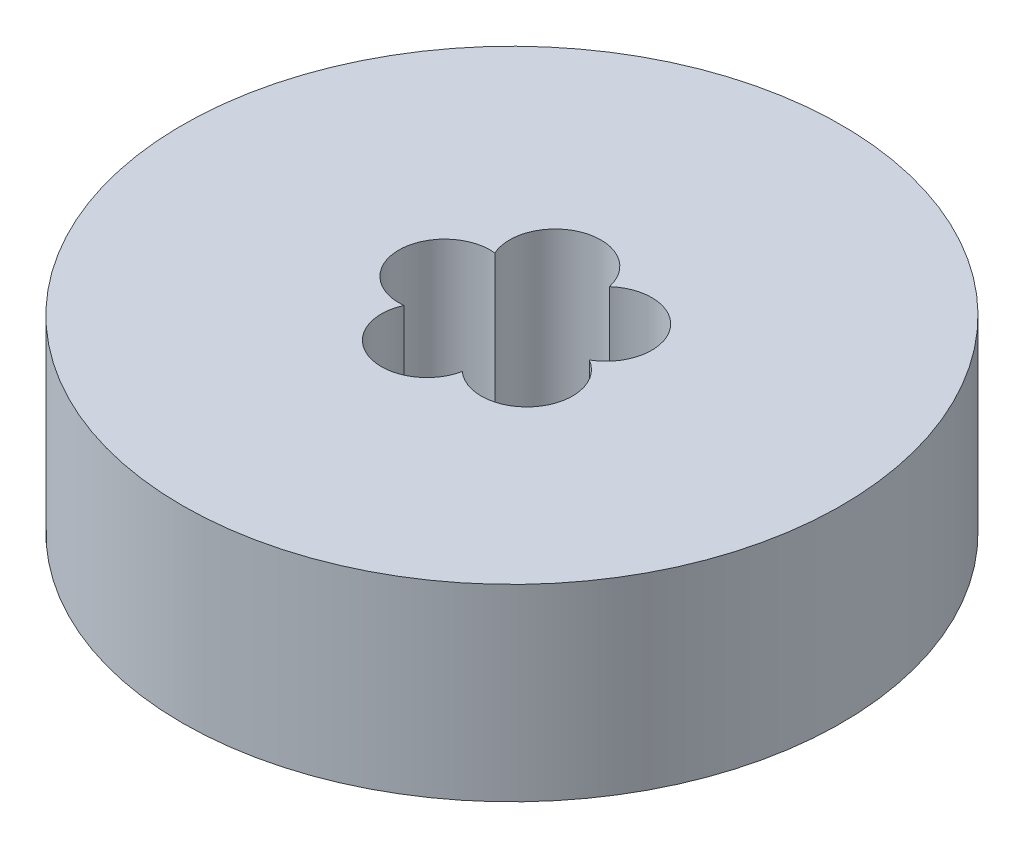
ISO-10303-21;
HEADER;
FILE_DESCRIPTION(('STEP AP214'),'2;1');
FILE_NAME('part.step','',(''),(''),'','','');
FILE_SCHEMA(('AUTOMOTIVE_DESIGN { 1 0 10303 214 1 1 1 1 }'));
ENDSEC;
DATA;
#1=APPLICATION_CONTEXT('core data for automotive mechanical design processes');
#2=APPLICATION_PROTOCOL_DEFINITION('international standard','automotive_design',2000,#1);
#3=PRODUCT_CONTEXT('',#1,'mechanical');
#4=PRODUCT('Part','Part','',(#3));
#5=PRODUCT_RELATED_PRODUCT_CATEGORY('part','',(#4));
#6=PRODUCT_DEFINITION_FORMATION('','',#4);
#7=PRODUCT_DEFINITION_CONTEXT('part definition',#1,'design');
#8=PRODUCT_DEFINITION('design','',#6,#7);
#9=PRODUCT_DEFINITION_SHAPE('','',#8);
#10=(LENGTH_UNIT() NAMED_UNIT(*) SI_UNIT(.MILLI.,.METRE.));
#11=(NAMED_UNIT(*) PLANE_ANGLE_UNIT() SI_UNIT($,.RADIAN.));
#12=(NAMED_UNIT(*) SI_UNIT($,.STERADIAN.) SOLID_ANGLE_UNIT());
#13=UNCERTAINTY_MEASURE_WITH_UNIT(LENGTH_MEASURE(1.E-05),#10,'distance_accuracy_value','');
#14=(GEOMETRIC_REPRESENTATION_CONTEXT(3) GLOBAL_UNCERTAINTY_ASSIGNED_CONTEXT((#13)) GLOBAL_UNIT_ASSIGNED_CONTEXT((#10,
#11,#12)) REPRESENTATION_CONTEXT('',''));
#15=CARTESIAN_POINT('',(0.,0.,0.));
#16=DIRECTION('',(0.,0.,1.));
#17=DIRECTION('',(1.,0.,0.));
#18=AXIS2_PLACEMENT_3D('',#15,#16,#17);
#19=CARTESIAN_POINT('',(0.,20.,0.));
#20=DIRECTION('',(0.,-1.,0.));
#21=DIRECTION('',(0.,0.,-1.));
#22=AXIS2_PLACEMENT_3D('',#19,#20,#21);
#23=CYLINDRICAL_SURFACE('',#22,7.5);
#24=CARTESIAN_POINT('',(0.,0.,0.));
#25=DIRECTION('',(0.,1.,0.));
#26=DIRECTION('',(0.,0.,1.));
#27=AXIS2_PLACEMENT_3D('',#24,#25,#26);
#28=CIRCLE('',#27,7.5);
#29=CARTESIAN_POINT('',(0.,0.,7.5));
#30=VERTEX_POINT('',#29);
#31=EDGE_CURVE('E129',#30,#30,#28,.T.);
#32=ORIENTED_EDGE('',*,*,#31,.F.);
#33=EDGE_LOOP('',(#32));
#34=FACE_BOUND('',#33,.T.);
#35=CARTESIAN_POINT('',(0.,2.92474117576165,0.));
#36=DIRECTION('',(0.,1.,0.));
#37=DIRECTION('',(0.,0.,1.));
#38=AXIS2_PLACEMENT_3D('',#35,#36,#37);
#39=CIRCLE('',#38,7.5);
#40=CARTESIAN_POINT('',(0.,2.92474117576165,7.5));
#41=VERTEX_POINT('',#40);
#42=EDGE_CURVE('E11',#41,#41,#39,.T.);
#43=ORIENTED_EDGE('',*,*,#42,.T.);
#44=EDGE_LOOP('',(#43));
#45=FACE_BOUND('',#44,.T.);
#46=ADVANCED_FACE('F39',(#34,#45),#23,.F.);
#47=CARTESIAN_POINT('',(0.,20.,0.));
#48=DIRECTION('',(0.,-1.,0.));
#49=DIRECTION('',(0.,0.,-1.));
#50=AXIS2_PLACEMENT_3D('',#47,#48,#49);
#51=CYLINDRICAL_SURFACE('',#50,35.);
#52=CARTESIAN_POINT('',(0.,20.,0.));
#53=DIRECTION('',(0.,1.,0.));
#54=DIRECTION('',(0.,0.,1.));
#55=AXIS2_PLACEMENT_3D('',#52,#53,#54);
#56=CIRCLE('',#55,35.);
#57=CARTESIAN_POINT('',(0.,20.,35.));
#58=VERTEX_POINT('',#57);
#59=EDGE_CURVE('E50',#58,#58,#56,.T.);
#60=ORIENTED_EDGE('',*,*,#59,.F.);
#61=EDGE_LOOP('',(#60));
#62=FACE_BOUND('',#61,.T.);
#63=CARTESIAN_POINT('',(0.,0.,0.));
#64=DIRECTION('',(0.,1.,0.));
#65=DIRECTION('',(0.,0.,1.));
#66=AXIS2_PLACEMENT_3D('',#63,#64,#65);
#67=CIRCLE('',#66,35.);
#68=CARTESIAN_POINT('',(0.,0.,35.));
#69=VERTEX_POINT('',#68);
#70=EDGE_CURVE('E133',#69,#69,#67,.T.);
#71=ORIENTED_EDGE('',*,*,#70,.T.);
#72=EDGE_LOOP('',(#71));
#73=FACE_BOUND('',#72,.T.);
#74=ADVANCED_FACE('F41',(#62,#73),#51,.T.);
#75=CARTESIAN_POINT('',(0.,20.,0.));
#76=DIRECTION('',(0.,1.,0.));
#77=DIRECTION('',(0.,0.,1.));
#78=AXIS2_PLACEMENT_3D('',#75,#76,#77);
#79=PLANE('',#78);
#80=CARTESIAN_POINT('',(-2.21156504567172,20.,6.80649733245616));
#81=DIRECTION('',(0.,1.,0.));
#82=DIRECTION('',(0.951056516295155,0.,0.309016994374945));
#83=AXIS2_PLACEMENT_3D('',#80,#81,#82);
#84=CIRCLE('',#83,4.8551769473267);
#85=CARTESIAN_POINT('',(-6.64540914423591,20.,4.82817235928312));
#86=VERTEX_POINT('',#85);
#87=CARTESIAN_POINT('',(2.5383204239488,20.,7.81214698086283));
#88=VERTEX_POINT('',#87);
#89=EDGE_CURVE('E119',#86,#88,#84,.T.);
#90=ORIENTED_EDGE('',*,*,#89,.F.);
#91=CARTESIAN_POINT('',(-7.15677482445618,20.,0.));
#92=DIRECTION('',(0.,1.,0.));
#93=DIRECTION('',(0.,0.,1.));
#94=AXIS2_PLACEMENT_3D('',#91,#92,#93);
#95=CIRCLE('',#94,4.8551769473267);
#96=CARTESIAN_POINT('',(-6.64540914423603,20.,-4.82817235928313));
#97=VERTEX_POINT('',#96);
#98=EDGE_CURVE('E127',#97,#86,#95,.T.);
#99=ORIENTED_EDGE('',*,*,#98,.F.);
#100=CARTESIAN_POINT('',(-2.21156504567182,20.,-6.80649733245613));
#101=DIRECTION('',(0.,1.,0.));
#102=DIRECTION('',(-0.95105651629515,0.,0.309016994374958));
#103=AXIS2_PLACEMENT_3D('',#100,#101,#102);
#104=CIRCLE('',#103,4.8551769473267);
#105=CARTESIAN_POINT('',(2.53832042394869,20.,-7.81214698086286));
#106=VERTEX_POINT('',#105);
#107=EDGE_CURVE('E53',#106,#97,#104,.T.);
#108=ORIENTED_EDGE('',*,*,#107,.F.);
#109=CARTESIAN_POINT('',(5.7899524578998,20.,-4.20664669579345));
#110=DIRECTION('',(0.,1.,0.));
#111=DIRECTION('',(-0.58778525229248,0.,-0.809016994374942));
#112=AXIS2_PLACEMENT_3D('',#109,#110,#111);
#113=CIRCLE('',#112,4.8551769473267);
#114=CARTESIAN_POINT('',(8.2141774405743,20.,0.));
#115=VERTEX_POINT('',#114);
#116=EDGE_CURVE('E99',#115,#106,#113,.T.);
#117=ORIENTED_EDGE('',*,*,#116,.F.);
#118=CARTESIAN_POINT('',(5.78995245789986,20.,4.20664669579336));
#119=DIRECTION('',(0.,1.,0.));
#120=DIRECTION('',(0.587785252292469,0.,-0.809016994374951));
#121=AXIS2_PLACEMENT_3D('',#118,#119,#120);
#122=CIRCLE('',#121,4.8551769473267);
#123=EDGE_CURVE('E113',#88,#115,#122,.T.);
#124=ORIENTED_EDGE('',*,*,#123,.F.);
#125=EDGE_LOOP('',(#90,#99,#108,#117,#124));
#126=FACE_BOUND('',#125,.T.);
#127=ORIENTED_EDGE('',*,*,#59,.T.);
#128=EDGE_LOOP('',(#127));
#129=FACE_BOUND('',#128,.T.);
#130=ADVANCED_FACE('F141',(#126,#129),#79,.T.);
#131=CARTESIAN_POINT('',(0.,0.,0.));
#132=DIRECTION('',(0.,1.,0.));
#133=DIRECTION('',(0.,0.,1.));
#134=AXIS2_PLACEMENT_3D('',#131,#132,#133);
#135=PLANE('',#134);
#136=ORIENTED_EDGE('',*,*,#31,.T.);
#137=EDGE_LOOP('',(#136));
#138=FACE_BOUND('',#137,.T.);
#139=ORIENTED_EDGE('',*,*,#70,.F.);
#140=EDGE_LOOP('',(#139));
#141=FACE_BOUND('',#140,.T.);
#142=ADVANCED_FACE('F139',(#138,#141),#135,.F.);
#143=CARTESIAN_POINT('',(-7.15677482445618,2.92474117576165,0.));
#144=DIRECTION('',(0.,1.,0.));
#145=DIRECTION('',(0.,0.,1.));
#146=AXIS2_PLACEMENT_3D('',#143,#144,#145);
#147=CYLINDRICAL_SURFACE('',#146,4.8551769473267);
#148=ORIENTED_EDGE('',*,*,#98,.T.);
#149=DIRECTION('',(0.,1.,0.));
#150=VECTOR('',#149,1.);
#151=CARTESIAN_POINT('',(-6.64540914423591,11.4623705878808,4.82817235928312));
#152=LINE('',#151,#150);
#153=CARTESIAN_POINT('',(-6.64540914423591,2.92474117576165,4.82817235928312));
#154=VERTEX_POINT('',#153);
#155=EDGE_CURVE('E65',#86,#154,#152,.F.);
#156=ORIENTED_EDGE('',*,*,#155,.T.);
#157=CARTESIAN_POINT('',(-7.15677482445618,2.92474117576165,0.));
#158=DIRECTION('',(0.,1.,0.));
#159=DIRECTION('',(0.,0.,1.));
#160=AXIS2_PLACEMENT_3D('',#157,#158,#159);
#161=CIRCLE('',#160,4.8551769473267);
#162=CARTESIAN_POINT('',(-6.64540914423603,2.92474117576165,-4.82817235928313));
#163=VERTEX_POINT('',#162);
#164=EDGE_CURVE('E130',#163,#154,#161,.T.);
#165=ORIENTED_EDGE('',*,*,#164,.F.);
#166=DIRECTION('',(0.,1.,0.));
#167=VECTOR('',#166,1.);
#168=CARTESIAN_POINT('',(-6.64540914423603,11.4623705878808,-4.82817235928313));
#169=LINE('',#168,#167);
#170=EDGE_CURVE('E108',#163,#97,#169,.T.);
#171=ORIENTED_EDGE('',*,*,#170,.T.);
#172=EDGE_LOOP('',(#148,#156,#165,#171));
#173=FACE_BOUND('',#172,.T.);
#174=ADVANCED_FACE('F142',(#173),#147,.F.);
#175=CARTESIAN_POINT('',(-7.15677482445618,2.92474117576165,0.));
#176=DIRECTION('',(0.,1.,0.));
#177=DIRECTION('',(0.,0.,1.));
#178=AXIS2_PLACEMENT_3D('',#175,#176,#177);
#179=PLANE('',#178);
#180=ORIENTED_EDGE('',*,*,#164,.T.);
#181=CARTESIAN_POINT('',(-2.21156504567172,2.92474117576165,6.80649733245616));
#182=DIRECTION('',(0.,1.,0.));
#183=DIRECTION('',(0.951056516295155,0.,0.309016994374945));
#184=AXIS2_PLACEMENT_3D('',#181,#182,#183);
#185=CIRCLE('',#184,4.8551769473267);
#186=CARTESIAN_POINT('',(2.5383204239488,2.92474117576165,7.81214698086283));
#187=VERTEX_POINT('',#186);
#188=EDGE_CURVE('E121',#154,#187,#185,.T.);
#189=ORIENTED_EDGE('',*,*,#188,.T.);
#190=CARTESIAN_POINT('',(5.78995245789986,2.92474117576165,4.20664669579336));
#191=DIRECTION('',(0.,1.,0.));
#192=DIRECTION('',(0.587785252292469,0.,-0.809016994374951));
#193=AXIS2_PLACEMENT_3D('',#190,#191,#192);
#194=CIRCLE('',#193,4.8551769473267);
#195=CARTESIAN_POINT('',(8.2141774405743,2.92474117576165,0.));
#196=VERTEX_POINT('',#195);
#197=EDGE_CURVE('E92',#187,#196,#194,.T.);
#198=ORIENTED_EDGE('',*,*,#197,.T.);
#199=CARTESIAN_POINT('',(5.7899524578998,2.92474117576165,-4.20664669579345));
#200=DIRECTION('',(0.,1.,0.));
#201=DIRECTION('',(-0.58778525229248,0.,-0.809016994374942));
#202=AXIS2_PLACEMENT_3D('',#199,#200,#201);
#203=CIRCLE('',#202,4.8551769473267);
#204=CARTESIAN_POINT('',(2.53832042394869,2.92474117576165,-7.81214698086286));
#205=VERTEX_POINT('',#204);
#206=EDGE_CURVE('E88',#196,#205,#203,.T.);
#207=ORIENTED_EDGE('',*,*,#206,.T.);
#208=CARTESIAN_POINT('',(-2.21156504567182,2.92474117576165,-6.80649733245613));
#209=DIRECTION('',(0.,1.,0.));
#210=DIRECTION('',(-0.95105651629515,0.,0.309016994374958));
#211=AXIS2_PLACEMENT_3D('',#208,#209,#210);
#212=CIRCLE('',#211,4.8551769473267);
#213=EDGE_CURVE('E95',#205,#163,#212,.T.);
#214=ORIENTED_EDGE('',*,*,#213,.T.);
#215=EDGE_LOOP('',(#180,#189,#198,#207,#214));
#216=FACE_BOUND('',#215,.T.);
#217=ORIENTED_EDGE('',*,*,#42,.F.);
#218=EDGE_LOOP('',(#217));
#219=FACE_BOUND('',#218,.T.);
#220=ADVANCED_FACE('F90',(#216,#219),#179,.T.);
#221=CARTESIAN_POINT('',(-2.21156504567172,2.92474117576165,6.80649733245616));
#222=DIRECTION('',(0.,1.,0.));
#223=DIRECTION('',(0.,0.,1.));
#224=AXIS2_PLACEMENT_3D('',#221,#222,#223);
#225=CYLINDRICAL_SURFACE('',#224,4.8551769473267);
#226=ORIENTED_EDGE('',*,*,#89,.T.);
#227=DIRECTION('',(0.,1.,0.));
#228=VECTOR('',#227,1.);
#229=CARTESIAN_POINT('',(2.5383204239488,11.4623705878808,7.81214698086283));
#230=LINE('',#229,#228);
#231=EDGE_CURVE('E106',#88,#187,#230,.F.);
#232=ORIENTED_EDGE('',*,*,#231,.T.);
#233=ORIENTED_EDGE('',*,*,#188,.F.);
#234=ORIENTED_EDGE('',*,*,#155,.F.);
#235=EDGE_LOOP('',(#226,#232,#233,#234));
#236=FACE_BOUND('',#235,.T.);
#237=ADVANCED_FACE('F164',(#236),#225,.F.);
#238=CARTESIAN_POINT('',(-2.21156504567182,2.92474117576165,-6.80649733245613));
#239=DIRECTION('',(0.,1.,0.));
#240=DIRECTION('',(0.,0.,1.));
#241=AXIS2_PLACEMENT_3D('',#238,#239,#240);
#242=CYLINDRICAL_SURFACE('',#241,4.8551769473267);
#243=ORIENTED_EDGE('',*,*,#213,.F.);
#244=DIRECTION('',(0.,1.,0.));
#245=VECTOR('',#244,1.);
#246=CARTESIAN_POINT('',(2.53832042394869,11.4623705878808,-7.81214698086286));
#247=LINE('',#246,#245);
#248=EDGE_CURVE('E103',#106,#205,#247,.F.);
#249=ORIENTED_EDGE('',*,*,#248,.F.);
#250=ORIENTED_EDGE('',*,*,#107,.T.);
#251=ORIENTED_EDGE('',*,*,#170,.F.);
#252=EDGE_LOOP('',(#243,#249,#250,#251));
#253=FACE_BOUND('',#252,.T.);
#254=ADVANCED_FACE('F107',(#253),#242,.F.);
#255=CARTESIAN_POINT('',(5.78995245789986,2.92474117576165,4.20664669579336));
#256=DIRECTION('',(0.,1.,0.));
#257=DIRECTION('',(0.,0.,1.));
#258=AXIS2_PLACEMENT_3D('',#255,#256,#257);
#259=CYLINDRICAL_SURFACE('',#258,4.8551769473267);
#260=ORIENTED_EDGE('',*,*,#123,.T.);
#261=DIRECTION('',(0.,1.,0.));
#262=VECTOR('',#261,1.);
#263=CARTESIAN_POINT('',(8.2141774405743,11.4623705878808,0.));
#264=LINE('',#263,#262);
#265=EDGE_CURVE('E97',#115,#196,#264,.F.);
#266=ORIENTED_EDGE('',*,*,#265,.T.);
#267=ORIENTED_EDGE('',*,*,#197,.F.);
#268=ORIENTED_EDGE('',*,*,#231,.F.);
#269=EDGE_LOOP('',(#260,#266,#267,#268));
#270=FACE_BOUND('',#269,.T.);
#271=ADVANCED_FACE('F169',(#270),#259,.F.);
#272=CARTESIAN_POINT('',(5.7899524578998,2.92474117576165,-4.20664669579345));
#273=DIRECTION('',(0.,1.,0.));
#274=DIRECTION('',(0.,0.,1.));
#275=AXIS2_PLACEMENT_3D('',#272,#273,#274);
#276=CYLINDRICAL_SURFACE('',#275,4.8551769473267);
#277=ORIENTED_EDGE('',*,*,#248,.T.);
#278=ORIENTED_EDGE('',*,*,#206,.F.);
#279=ORIENTED_EDGE('',*,*,#265,.F.);
#280=ORIENTED_EDGE('',*,*,#116,.T.);
#281=EDGE_LOOP('',(#277,#278,#279,#280));
#282=FACE_BOUND('',#281,.T.);
#283=ADVANCED_FACE('F102',(#282),#276,.F.);
#284=CLOSED_SHELL('',(#46,#74,#130,#142,#174,#220,#237,#254,#271,#283));
#285=MANIFOLD_SOLID_BREP('B2',#284);
#286=ADVANCED_BREP_SHAPE_REPRESENTATION('',(#18,#285),#14);
#287=SHAPE_DEFINITION_REPRESENTATION(#9,#286);
ENDSEC;
END-ISO-10303-21;
